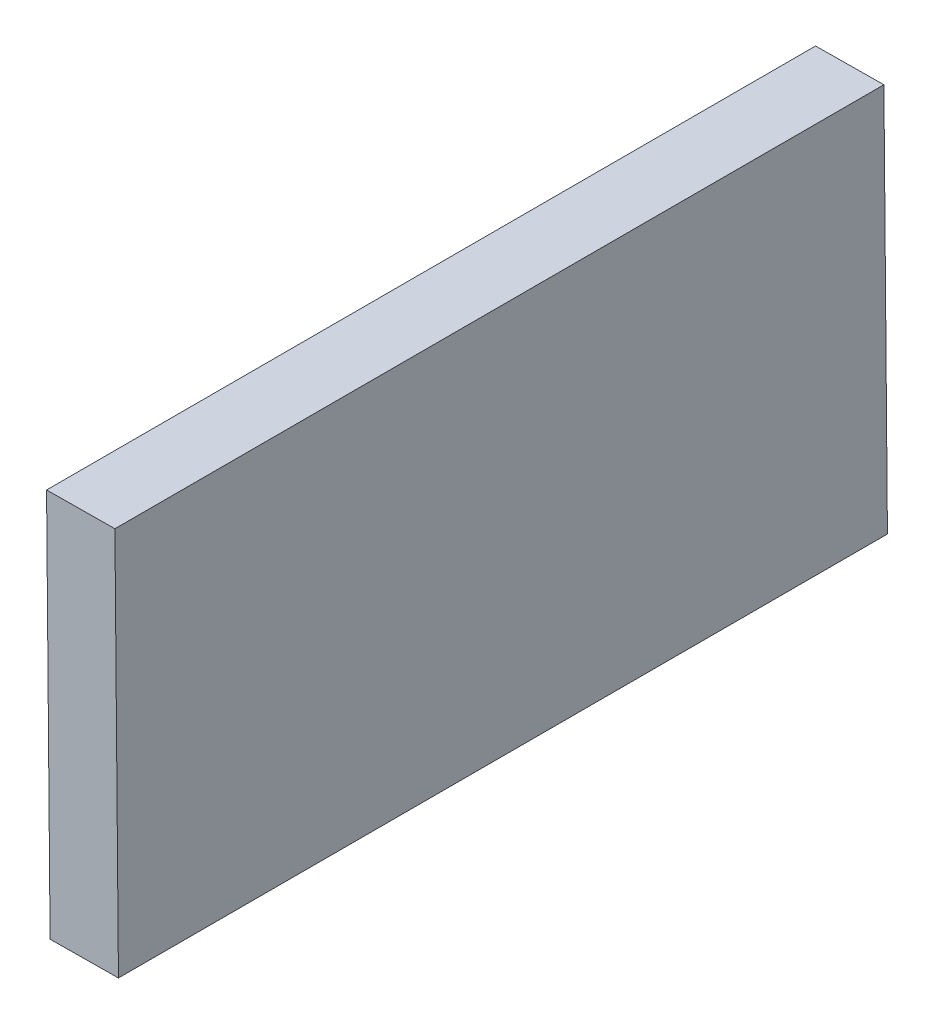
ISO-10303-21;
HEADER;
FILE_DESCRIPTION(('STEP AP214'),'2;1');
FILE_NAME('part.step','',(''),(''),'','','');
FILE_SCHEMA(('AUTOMOTIVE_DESIGN { 1 0 10303 214 1 1 1 1 }'));
ENDSEC;
DATA;
#1=APPLICATION_CONTEXT('core data for automotive mechanical design processes');
#2=APPLICATION_PROTOCOL_DEFINITION('international standard','automotive_design',2000,#1);
#3=PRODUCT_CONTEXT('',#1,'mechanical');
#4=PRODUCT('Part','Part','',(#3));
#5=PRODUCT_RELATED_PRODUCT_CATEGORY('part','',(#4));
#6=PRODUCT_DEFINITION_FORMATION('','',#4);
#7=PRODUCT_DEFINITION_CONTEXT('part definition',#1,'design');
#8=PRODUCT_DEFINITION('design','',#6,#7);
#9=PRODUCT_DEFINITION_SHAPE('','',#8);
#10=(LENGTH_UNIT() NAMED_UNIT(*) SI_UNIT(.MILLI.,.METRE.));
#11=(NAMED_UNIT(*) PLANE_ANGLE_UNIT() SI_UNIT($,.RADIAN.));
#12=(NAMED_UNIT(*) SI_UNIT($,.STERADIAN.) SOLID_ANGLE_UNIT());
#13=UNCERTAINTY_MEASURE_WITH_UNIT(LENGTH_MEASURE(1.E-05),#10,'distance_accuracy_value','');
#14=(GEOMETRIC_REPRESENTATION_CONTEXT(3) GLOBAL_UNCERTAINTY_ASSIGNED_CONTEXT((#13)) GLOBAL_UNIT_ASSIGNED_CONTEXT((#10,
#11,#12)) REPRESENTATION_CONTEXT('',''));
#15=CARTESIAN_POINT('',(0.,0.,0.));
#16=DIRECTION('',(0.,0.,1.));
#17=DIRECTION('',(1.,0.,0.));
#18=AXIS2_PLACEMENT_3D('',#15,#16,#17);
#19=CARTESIAN_POINT('',(4.9419515566157,-0.153530734211842,-0.65));
#20=DIRECTION('',(0.99995839142584,0.00912224846437137,0.));
#21=DIRECTION('',(0.,0.,-1.));
#22=AXIS2_PLACEMENT_3D('',#19,#20,#21);
#23=PLANE('',#22);
#24=DIRECTION('',(0.00912224846437137,-0.99995839142584,0.));
#25=VECTOR('',#24,1.);
#26=CARTESIAN_POINT('',(4.91093591183683,3.24632779663602,-7.4));
#27=LINE('',#26,#25);
#28=CARTESIAN_POINT('',(4.91093591183683,3.24632779663602,-7.4));
#29=VERTEX_POINT('',#28);
#30=CARTESIAN_POINT('',(4.97296720139456,-3.5533892650597,-7.4));
#31=VERTEX_POINT('',#30);
#32=EDGE_CURVE('E11',#29,#31,#27,.T.);
#33=ORIENTED_EDGE('',*,*,#32,.F.);
#34=DIRECTION('',(0.,0.,-1.));
#35=VECTOR('',#34,1.);
#36=CARTESIAN_POINT('',(4.91093591183683,3.24632779663602,6.1));
#37=LINE('',#36,#35);
#38=CARTESIAN_POINT('',(4.91093591183683,3.24632779663602,6.1));
#39=VERTEX_POINT('',#38);
#40=EDGE_CURVE('E104',#39,#29,#37,.T.);
#41=ORIENTED_EDGE('',*,*,#40,.F.);
#42=DIRECTION('',(-0.00912224846437137,0.99995839142584,0.));
#43=VECTOR('',#42,1.);
#44=CARTESIAN_POINT('',(4.97296720139456,-3.5533892650597,6.1));
#45=LINE('',#44,#43);
#46=CARTESIAN_POINT('',(4.97296720139456,-3.5533892650597,6.1));
#47=VERTEX_POINT('',#46);
#48=EDGE_CURVE('E78',#47,#39,#45,.T.);
#49=ORIENTED_EDGE('',*,*,#48,.F.);
#50=DIRECTION('',(0.,0.,1.));
#51=VECTOR('',#50,1.);
#52=CARTESIAN_POINT('',(4.97296720139456,-3.5533892650597,-7.4));
#53=LINE('',#52,#51);
#54=EDGE_CURVE('E45',#31,#47,#53,.T.);
#55=ORIENTED_EDGE('',*,*,#54,.F.);
#56=EDGE_LOOP('',(#33,#41,#49,#55));
#57=FACE_BOUND('',#56,.T.);
#58=ADVANCED_FACE('F17',(#57),#23,.T.);
#59=CARTESIAN_POINT('',(3.77301713168355,-3.56433596321694,-7.4));
#60=DIRECTION('',(0.,0.,-1.));
#61=DIRECTION('',(0.,-1.,0.));
#62=AXIS2_PLACEMENT_3D('',#59,#60,#61);
#63=PLANE('',#62);
#64=ORIENTED_EDGE('',*,*,#32,.T.);
#65=DIRECTION('',(-0.99995839142584,-0.00912224846437137,0.));
#66=VECTOR('',#65,1.);
#67=CARTESIAN_POINT('',(4.97296720139456,-3.5533892650597,-7.4));
#68=LINE('',#67,#66);
#69=CARTESIAN_POINT('',(3.77301713168355,-3.56433596321694,-7.4));
#70=VERTEX_POINT('',#69);
#71=EDGE_CURVE('E20',#31,#70,#68,.T.);
#72=ORIENTED_EDGE('',*,*,#71,.T.);
#73=DIRECTION('',(0.00912224846437137,-0.99995839142584,0.));
#74=VECTOR('',#73,1.);
#75=CARTESIAN_POINT('',(3.71098584212583,3.23538109847877,-7.4));
#76=LINE('',#75,#74);
#77=CARTESIAN_POINT('',(3.71098584212583,3.23538109847877,-7.4));
#78=VERTEX_POINT('',#77);
#79=EDGE_CURVE('E93',#78,#70,#76,.T.);
#80=ORIENTED_EDGE('',*,*,#79,.F.);
#81=DIRECTION('',(-0.99995839142584,-0.00912224846437137,0.));
#82=VECTOR('',#81,1.);
#83=CARTESIAN_POINT('',(4.91093591183683,3.24632779663602,-7.4));
#84=LINE('',#83,#82);
#85=EDGE_CURVE('E107',#29,#78,#84,.T.);
#86=ORIENTED_EDGE('',*,*,#85,.F.);
#87=EDGE_LOOP('',(#64,#72,#80,#86));
#88=FACE_BOUND('',#87,.T.);
#89=ADVANCED_FACE('F117',(#88),#63,.T.);
#90=CARTESIAN_POINT('',(3.77301713168355,-3.56433596321694,6.1));
#91=DIRECTION('',(0.00912224846437137,-0.99995839142584,0.));
#92=DIRECTION('',(0.,0.,-1.));
#93=AXIS2_PLACEMENT_3D('',#90,#91,#92);
#94=PLANE('',#93);
#95=ORIENTED_EDGE('',*,*,#54,.T.);
#96=DIRECTION('',(0.99995839142584,0.00912224846437137,0.));
#97=VECTOR('',#96,1.);
#98=CARTESIAN_POINT('',(3.77301713168355,-3.56433596321694,6.1));
#99=LINE('',#98,#97);
#100=CARTESIAN_POINT('',(3.77301713168355,-3.56433596321694,6.1));
#101=VERTEX_POINT('',#100);
#102=EDGE_CURVE('E69',#101,#47,#99,.T.);
#103=ORIENTED_EDGE('',*,*,#102,.F.);
#104=DIRECTION('',(0.,0.,1.));
#105=VECTOR('',#104,1.);
#106=CARTESIAN_POINT('',(3.77301713168355,-3.56433596321694,-7.4));
#107=LINE('',#106,#105);
#108=EDGE_CURVE('E73',#70,#101,#107,.T.);
#109=ORIENTED_EDGE('',*,*,#108,.F.);
#110=ORIENTED_EDGE('',*,*,#71,.F.);
#111=EDGE_LOOP('',(#95,#103,#109,#110));
#112=FACE_BOUND('',#111,.T.);
#113=ADVANCED_FACE('F71',(#112),#94,.T.);
#114=CARTESIAN_POINT('',(3.71098584212583,3.23538109847877,6.1));
#115=DIRECTION('',(0.,0.,1.));
#116=DIRECTION('',(1.,0.,0.));
#117=AXIS2_PLACEMENT_3D('',#114,#115,#116);
#118=PLANE('',#117);
#119=ORIENTED_EDGE('',*,*,#48,.T.);
#120=DIRECTION('',(-0.99995839142584,-0.00912224846437137,0.));
#121=VECTOR('',#120,1.);
#122=CARTESIAN_POINT('',(4.91093591183683,3.24632779663602,6.1));
#123=LINE('',#122,#121);
#124=CARTESIAN_POINT('',(3.71098584212583,3.23538109847877,6.1));
#125=VERTEX_POINT('',#124);
#126=EDGE_CURVE('E84',#39,#125,#123,.T.);
#127=ORIENTED_EDGE('',*,*,#126,.T.);
#128=DIRECTION('',(-0.00912224846437137,0.99995839142584,0.));
#129=VECTOR('',#128,1.);
#130=CARTESIAN_POINT('',(3.77301713168355,-3.56433596321694,6.1));
#131=LINE('',#130,#129);
#132=EDGE_CURVE('E81',#101,#125,#131,.T.);
#133=ORIENTED_EDGE('',*,*,#132,.F.);
#134=ORIENTED_EDGE('',*,*,#102,.T.);
#135=EDGE_LOOP('',(#119,#127,#133,#134));
#136=FACE_BOUND('',#135,.T.);
#137=ADVANCED_FACE('F82',(#136),#118,.T.);
#138=CARTESIAN_POINT('',(3.71098584212583,3.23538109847877,-7.4));
#139=DIRECTION('',(-0.00912224846437137,0.99995839142584,0.));
#140=DIRECTION('',(0.,0.,1.));
#141=AXIS2_PLACEMENT_3D('',#138,#139,#140);
#142=PLANE('',#141);
#143=ORIENTED_EDGE('',*,*,#40,.T.);
#144=ORIENTED_EDGE('',*,*,#85,.T.);
#145=DIRECTION('',(0.,0.,-1.));
#146=VECTOR('',#145,1.);
#147=CARTESIAN_POINT('',(3.71098584212583,3.23538109847877,6.1));
#148=LINE('',#147,#146);
#149=EDGE_CURVE('E89',#125,#78,#148,.T.);
#150=ORIENTED_EDGE('',*,*,#149,.F.);
#151=ORIENTED_EDGE('',*,*,#126,.F.);
#152=EDGE_LOOP('',(#143,#144,#150,#151));
#153=FACE_BOUND('',#152,.T.);
#154=ADVANCED_FACE('F125',(#153),#142,.T.);
#155=CARTESIAN_POINT('',(3.74200148690469,-0.164477432369087,-0.65));
#156=DIRECTION('',(0.99995839142584,0.00912224846437137,0.));
#157=DIRECTION('',(0.,0.,-1.));
#158=AXIS2_PLACEMENT_3D('',#155,#156,#157);
#159=PLANE('',#158);
#160=ORIENTED_EDGE('',*,*,#79,.T.);
#161=ORIENTED_EDGE('',*,*,#108,.T.);
#162=ORIENTED_EDGE('',*,*,#132,.T.);
#163=ORIENTED_EDGE('',*,*,#149,.T.);
#164=EDGE_LOOP('',(#160,#161,#162,#163));
#165=FACE_BOUND('',#164,.T.);
#166=ADVANCED_FACE('F91',(#165),#159,.F.);
#167=CLOSED_SHELL('',(#58,#89,#113,#137,#154,#166));
#168=MANIFOLD_SOLID_BREP('B1',#167);
#169=ADVANCED_BREP_SHAPE_REPRESENTATION('',(#18,#168),#14);
#170=SHAPE_DEFINITION_REPRESENTATION(#9,#169);
ENDSEC;
END-ISO-10303-21;
